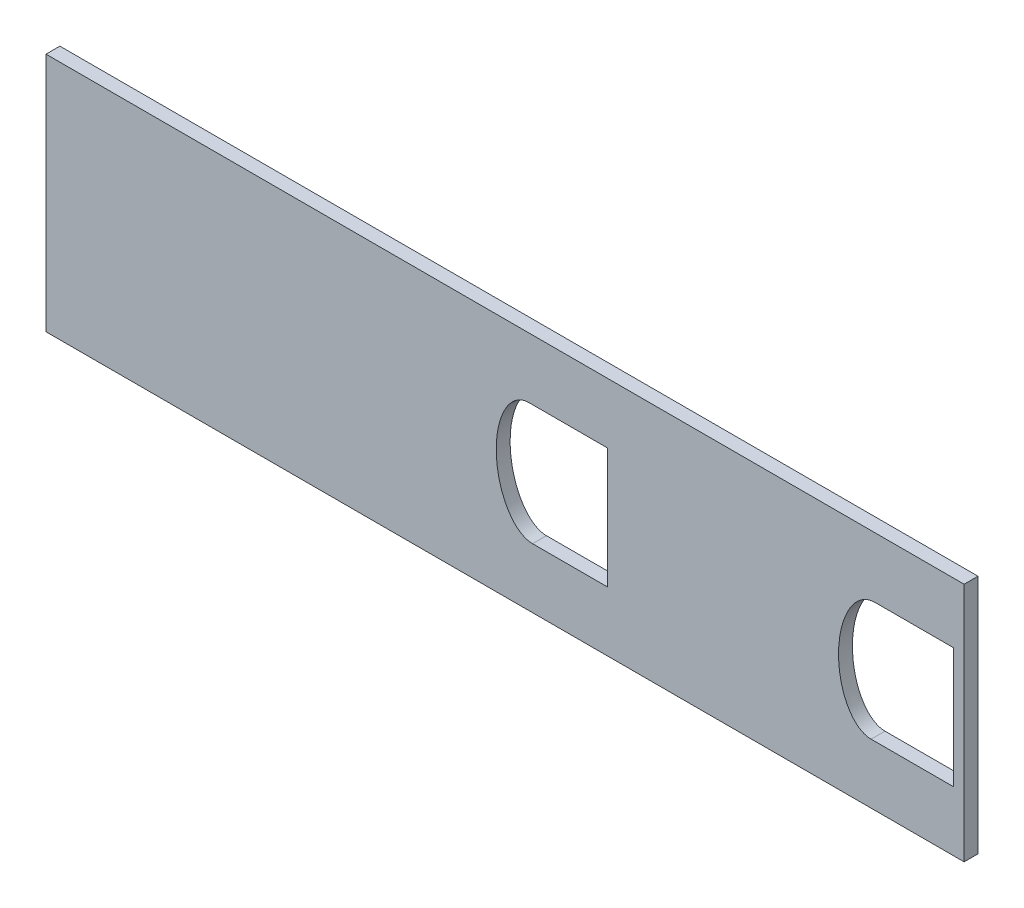
ISO-10303-21;
HEADER;
FILE_DESCRIPTION(('STEP AP214'),'2;1');
FILE_NAME('part.step','',(''),(''),'','','');
FILE_SCHEMA(('AUTOMOTIVE_DESIGN { 1 0 10303 214 1 1 1 1 }'));
ENDSEC;
DATA;
#1=APPLICATION_CONTEXT('core data for automotive mechanical design processes');
#2=APPLICATION_PROTOCOL_DEFINITION('international standard','automotive_design',2000,#1);
#3=PRODUCT_CONTEXT('',#1,'mechanical');
#4=PRODUCT('Part','Part','',(#3));
#5=PRODUCT_RELATED_PRODUCT_CATEGORY('part','',(#4));
#6=PRODUCT_DEFINITION_FORMATION('','',#4);
#7=PRODUCT_DEFINITION_CONTEXT('part definition',#1,'design');
#8=PRODUCT_DEFINITION('design','',#6,#7);
#9=PRODUCT_DEFINITION_SHAPE('','',#8);
#10=(LENGTH_UNIT() NAMED_UNIT(*) SI_UNIT(.MILLI.,.METRE.));
#11=(NAMED_UNIT(*) PLANE_ANGLE_UNIT() SI_UNIT($,.RADIAN.));
#12=(NAMED_UNIT(*) SI_UNIT($,.STERADIAN.) SOLID_ANGLE_UNIT());
#13=UNCERTAINTY_MEASURE_WITH_UNIT(LENGTH_MEASURE(1.E-05),#10,'distance_accuracy_value','');
#14=(GEOMETRIC_REPRESENTATION_CONTEXT(3) GLOBAL_UNCERTAINTY_ASSIGNED_CONTEXT((#13)) GLOBAL_UNIT_ASSIGNED_CONTEXT((#10,
#11,#12)) REPRESENTATION_CONTEXT('',''));
#15=CARTESIAN_POINT('',(0.,0.,0.));
#16=DIRECTION('',(0.,0.,1.));
#17=DIRECTION('',(1.,0.,0.));
#18=AXIS2_PLACEMENT_3D('',#15,#16,#17);
#19=CARTESIAN_POINT('',(0.,0.,3.175));
#20=DIRECTION('',(0.,0.,-1.));
#21=DIRECTION('',(-1.,0.,0.));
#22=AXIS2_PLACEMENT_3D('',#19,#20,#21);
#23=PLANE('',#22);
#24=CARTESIAN_POINT('',(-256.145946571245,-129.914535525207,3.175));
#25=CARTESIAN_POINT('',(-256.512923163438,-129.916105652913,3.175));
#26=CARTESIAN_POINT('',(-256.871976666252,-129.961276413136,3.175));
#27=CARTESIAN_POINT('',(-257.575127125787,-130.133923564444,3.175));
#28=CARTESIAN_POINT('',(-257.921636069417,-130.263410905777,3.175));
#29=CARTESIAN_POINT('',(-258.571621417541,-130.586176218645,3.175));
#30=CARTESIAN_POINT('',(-258.879489775578,-130.780210959598,3.175));
#31=CARTESIAN_POINT('',(-259.462810842354,-131.221200768919,3.175));
#32=CARTESIAN_POINT('',(-259.731937946974,-131.463068858512,3.175));
#33=CARTESIAN_POINT('',(-260.235067772947,-131.98012087023,3.175));
#34=CARTESIAN_POINT('',(-260.468977829019,-132.255392686313,3.175));
#35=CARTESIAN_POINT('',(-260.907271384866,-132.833942555549,3.175));
#36=CARTESIAN_POINT('',(-261.111268677679,-133.137182584867,3.175));
#37=CARTESIAN_POINT('',(-261.673586311515,-134.063668350993,3.175));
#38=CARTESIAN_POINT('',(-261.988251582681,-134.710018030615,3.175));
#39=CARTESIAN_POINT('',(-262.527518192638,-136.045634253011,3.175));
#40=CARTESIAN_POINT('',(-262.752464397444,-136.739423267185,3.175));
#41=CARTESIAN_POINT('',(-263.117244618423,-138.134526480922,3.175));
#42=CARTESIAN_POINT('',(-263.258245032942,-138.837666692454,3.175));
#43=CARTESIAN_POINT('',(-263.469446130367,-140.25350678251,3.175));
#44=CARTESIAN_POINT('',(-263.539513018113,-140.966224726598,3.175));
#45=CARTESIAN_POINT('',(-263.613946734782,-142.400531703257,3.175));
#46=CARTESIAN_POINT('',(-263.618118635488,-143.125138918939,3.175));
#47=CARTESIAN_POINT('',(-263.535049840951,-145.288890406299,3.175));
#48=CARTESIAN_POINT('',(-263.355011587131,-146.710051192057,3.175));
#49=CARTESIAN_POINT('',(-262.880494807648,-148.806791258549,3.175));
#50=CARTESIAN_POINT('',(-262.687866041162,-149.499806053937,3.175));
#51=CARTESIAN_POINT('',(-262.222220804156,-150.872074188592,3.175));
#52=CARTESIAN_POINT('',(-261.951824884298,-151.543353720329,3.175));
#53=CARTESIAN_POINT('',(-261.482245137831,-152.517058610564,3.175));
#54=CARTESIAN_POINT('',(-261.314868687399,-152.836389762082,3.175));
#55=CARTESIAN_POINT('',(-260.955397442808,-153.463120716963,3.175));
#56=CARTESIAN_POINT('',(-260.762547684987,-153.771633607421,3.175));
#57=CARTESIAN_POINT('',(-260.145999627634,-154.667359954438,3.175));
#58=CARTESIAN_POINT('',(-259.687952954573,-155.223199044971,3.175));
#59=CARTESIAN_POINT('',(-258.899796605441,-155.968133011314,3.175));
#60=CARTESIAN_POINT('',(-258.617726400451,-156.202737545982,3.175));
#61=CARTESIAN_POINT('',(-258.026082674822,-156.620875313244,3.175));
#62=CARTESIAN_POINT('',(-257.715719206334,-156.805710537517,3.175));
#63=CARTESIAN_POINT('',(-257.223224924768,-157.038052597829,3.175));
#64=CARTESIAN_POINT('',(-257.053549950963,-157.108271733492,3.175));
#65=CARTESIAN_POINT('',(-256.710372005906,-157.229384828597,3.175));
#66=CARTESIAN_POINT('',(-256.536705243704,-157.280483556748,3.175));
#67=CARTESIAN_POINT('',(-256.185019292948,-157.362869353131,3.175));
#68=CARTESIAN_POINT('',(-256.007000456909,-157.394158025959,3.175));
#69=CARTESIAN_POINT('',(-255.646351039637,-157.435743327176,3.175));
#70=CARTESIAN_POINT('',(-255.462490916157,-157.445957118728,3.175));
#71=CARTESIAN_POINT('',(-254.916901455293,-157.443363010651,3.175));
#72=CARTESIAN_POINT('',(-254.558988098448,-157.398217249218,3.175));
#73=CARTESIAN_POINT('',(-254.030633110303,-157.266900555764,3.175));
#74=CARTESIAN_POINT('',(-253.854994329901,-157.212068675881,3.175));
#75=CARTESIAN_POINT('',(-253.514081815182,-157.084218298334,3.175));
#76=CARTESIAN_POINT('',(-253.34814654925,-157.011165850916,3.175));
#77=CARTESIAN_POINT('',(-252.86269043692,-156.767076195649,3.175));
#78=CARTESIAN_POINT('',(-252.552918782358,-156.569092219785,3.175));
#79=CARTESIAN_POINT('',(-251.976637822077,-156.127865960309,3.175));
#80=CARTESIAN_POINT('',(-251.709745537613,-155.88536594729,3.175));
#81=CARTESIAN_POINT('',(-251.209661069469,-155.365652848024,3.175));
#82=CARTESIAN_POINT('',(-250.975927953497,-155.08752697638,3.175));
#83=CARTESIAN_POINT('',(-250.539799580046,-154.505348562684,3.175));
#84=CARTESIAN_POINT('',(-250.339793808974,-154.204740086727,3.175));
#85=CARTESIAN_POINT('',(-249.783603282288,-153.279811913683,3.175));
#86=CARTESIAN_POINT('',(-249.470669726552,-152.632692884761,3.175));
#87=CARTESIAN_POINT('',(-249.067336910667,-151.6271876715,3.175));
#88=CARTESIAN_POINT('',(-248.943832056116,-151.285125701367,3.175));
#89=CARTESIAN_POINT('',(-248.720010406052,-150.598517516299,3.175));
#90=CARTESIAN_POINT('',(-248.619326497605,-150.253217891313,3.175));
#91=CARTESIAN_POINT('',(-248.347462308419,-149.211953321545,3.175));
#92=CARTESIAN_POINT('',(-248.206246249024,-148.510662375128,3.175));
#93=CARTESIAN_POINT('',(-247.993321988715,-147.095725782209,3.175));
#94=CARTESIAN_POINT('',(-247.921729836956,-146.382059508507,3.175));
#95=CARTESIAN_POINT('',(-247.843955368269,-144.943100665753,3.175));
#96=CARTESIAN_POINT('',(-247.838198968214,-144.218551324163,3.175));
#97=CARTESIAN_POINT('',(-247.914798288682,-142.065525239397,3.175));
#98=CARTESIAN_POINT('',(-248.088499202911,-140.644600799141,3.175));
#99=CARTESIAN_POINT('',(-248.558002265887,-138.537794426442,3.175));
#100=CARTESIAN_POINT('',(-248.750893591281,-137.837154876669,3.175));
#101=CARTESIAN_POINT('',(-249.210496730663,-136.471911894025,3.175));
#102=CARTESIAN_POINT('',(-249.477345911885,-135.804616330621,3.175));
#103=CARTESIAN_POINT('',(-250.100264770085,-134.506934111839,3.175));
#104=CARTESIAN_POINT('',(-250.459274970147,-133.872000912881,3.175));
#105=CARTESIAN_POINT('',(-251.276468614764,-132.684294555382,3.175));
#106=CARTESIAN_POINT('',(-251.733816396469,-132.128803083096,3.175));
#107=CARTESIAN_POINT('',(-252.793005678947,-131.131520990881,3.175));
#108=CARTESIAN_POINT('',(-253.378396830112,-130.705090806128,3.175));
#109=CARTESIAN_POINT('',(-254.370141630469,-130.240586456427,3.175));
#110=CARTESIAN_POINT('',(-254.710681914565,-130.119988263396,3.175));
#111=CARTESIAN_POINT('',(-255.414197279891,-129.955919634128,3.175));
#112=CARTESIAN_POINT('',(-255.778969979051,-129.912965397501,3.175));
#113=CARTESIAN_POINT('',(-256.145946571245,-129.914535525207,3.175));
#114=B_SPLINE_CURVE_WITH_KNOTS('',3,(#24,#25,#26,#27,#28,#29,#30,#31,#32,#33,#34,#35,#36,#37,
#38,#39,#40,#41,#42,#43,#44,#45,#46,#47,#48,#49,#50,#51,#52,#53,#54,#55,#56,#57,#58,#59,#60,#61,
#62,#63,#64,#65,#66,#67,#68,#69,#70,#71,#72,#73,#74,#75,#76,#77,#78,#79,#80,#81,#82,#83,#84,#85,
#86,#87,#88,#89,#90,#91,#92,#93,#94,#95,#96,#97,#98,#99,#100,#101,#102,#103,#104,#105,#106,#107,
#108,#109,#110,#111,#112,#113),.UNSPECIFIED.,.T.,.F.,(4,2,2,2,2,2,2,2,2,2,2,2,2,2,2,2,2,2,2,2,2,
2,2,2,2,2,2,2,2,2,2,2,2,2,2,2,2,2,2,2,2,2,2,2,4),(0.,0.0156249999999996,0.0312499999999992,
0.0468749999999988,0.0624999999999983,0.0781249999999979,0.0937499999999975,0.124999999999998,
0.156249999999998,0.187499999999999,0.218749999999999,0.25,0.3125,0.343750000000001,
0.375000000000001,0.390625000000002,0.406250000000003,0.437500000000005,0.453125000000005,
0.468750000000005,0.476562500000004,0.484375000000003,0.492187500000002,0.500000000000001,
0.515625000000001,0.523437500000001,0.531250000000002,0.546875000000002,0.562500000000002,
0.578125000000002,0.593750000000003,0.625000000000002,0.640625000000003,0.656250000000004,
0.687500000000004,0.718750000000004,0.750000000000004,0.812500000000004,0.843750000000003,
0.875000000000002,0.90625,0.937499999999999,0.968749999999998,0.984374999999999,1.),.UNSPECIFIED.);
#115=CARTESIAN_POINT('',(-256.126515871853,-129.914493968034,3.175));
#116=VERTEX_POINT('',#115);
#117=CARTESIAN_POINT('',(-255.301947618532,-157.445143064841,3.175));
#118=VERTEX_POINT('',#117);
#119=EDGE_CURVE('E190',#116,#118,#114,.T.);
#120=ORIENTED_EDGE('',*,*,#119,.F.);
#121=DIRECTION('',(-1.,0.,0.));
#122=VECTOR('',#121,1.);
#123=CARTESIAN_POINT('',(-256.126515871853,-129.914493968034,3.175));
#124=LINE('',#123,#122);
#125=CARTESIAN_POINT('',(-238.126515871853,-129.914493968034,3.175));
#126=VERTEX_POINT('',#125);
#127=EDGE_CURVE('E205',#126,#116,#124,.T.);
#128=ORIENTED_EDGE('',*,*,#127,.F.);
#129=DIRECTION('',(0.,1.,0.));
#130=VECTOR('',#129,1.);
#131=CARTESIAN_POINT('',(-238.126515871853,-129.914493968034,3.175));
#132=LINE('',#131,#130);
#133=CARTESIAN_POINT('',(-238.126515871853,-157.445143064841,3.175));
#134=VERTEX_POINT('',#133);
#135=EDGE_CURVE('E202',#134,#126,#132,.T.);
#136=ORIENTED_EDGE('',*,*,#135,.F.);
#137=DIRECTION('',(1.,0.,0.));
#138=VECTOR('',#137,1.);
#139=CARTESIAN_POINT('',(-238.126515871853,-157.445143064841,3.175));
#140=LINE('',#139,#138);
#141=EDGE_CURVE('E195',#118,#134,#140,.T.);
#142=ORIENTED_EDGE('',*,*,#141,.F.);
#143=EDGE_LOOP('',(#120,#128,#136,#142));
#144=FACE_BOUND('',#143,.T.);
#145=DIRECTION('',(0.,-1.,0.));
#146=VECTOR('',#145,1.);
#147=CARTESIAN_POINT('',(-366.588298269733,-171.116742272036,3.175));
#148=LINE('',#147,#146);
#149=CARTESIAN_POINT('',(-366.588298269733,-116.116742272036,3.175));
#150=VERTEX_POINT('',#149);
#151=CARTESIAN_POINT('',(-366.588298269733,-171.116742272036,3.175));
#152=VERTEX_POINT('',#151);
#153=EDGE_CURVE('E233',#150,#152,#148,.T.);
#154=ORIENTED_EDGE('',*,*,#153,.T.);
#155=DIRECTION('',(1.,0.,0.));
#156=VECTOR('',#155,1.);
#157=CARTESIAN_POINT('',(-366.588298269733,-171.116742272036,3.175));
#158=LINE('',#157,#156);
#159=CARTESIAN_POINT('',(-156.588298269734,-171.116742272036,3.175));
#160=VERTEX_POINT('',#159);
#161=EDGE_CURVE('E236',#152,#160,#158,.T.);
#162=ORIENTED_EDGE('',*,*,#161,.T.);
#163=DIRECTION('',(0.,1.,0.));
#164=VECTOR('',#163,1.);
#165=CARTESIAN_POINT('',(-156.588298269734,-171.116742272036,3.175));
#166=LINE('',#165,#164);
#167=CARTESIAN_POINT('',(-156.588298269734,-116.116742272035,3.175));
#168=VERTEX_POINT('',#167);
#169=EDGE_CURVE('E239',#160,#168,#166,.T.);
#170=ORIENTED_EDGE('',*,*,#169,.T.);
#171=DIRECTION('',(-1.,0.,0.));
#172=VECTOR('',#171,1.);
#173=CARTESIAN_POINT('',(-366.588298269733,-116.116742272036,3.175));
#174=LINE('',#173,#172);
#175=EDGE_CURVE('E241',#168,#150,#174,.T.);
#176=ORIENTED_EDGE('',*,*,#175,.T.);
#177=EDGE_LOOP('',(#154,#162,#170,#176));
#178=FACE_BOUND('',#177,.T.);
#179=DIRECTION('',(1.,0.,0.));
#180=VECTOR('',#179,1.);
#181=CARTESIAN_POINT('',(-159.040464823858,-157.445142266956,3.175));
#182=LINE('',#181,#180);
#183=CARTESIAN_POINT('',(-177.864702911853,-157.445142266956,3.175));
#184=VERTEX_POINT('',#183);
#185=CARTESIAN_POINT('',(-159.040464823858,-157.445142266956,3.175));
#186=VERTEX_POINT('',#185);
#187=EDGE_CURVE('E126',#184,#186,#182,.T.);
#188=ORIENTED_EDGE('',*,*,#187,.F.);
#189=CARTESIAN_POINT('',(-177.020649968222,-129.914535525207,3.175));
#190=CARTESIAN_POINT('',(-177.387321809055,-129.912966701395,3.175));
#191=CARTESIAN_POINT('',(-177.746354088471,-129.95496307965,3.175));
#192=CARTESIAN_POINT('',(-178.450508163983,-130.118281465425,3.175));
#193=CARTESIAN_POINT('',(-178.798446547902,-130.241521216158,3.175));
#194=CARTESIAN_POINT('',(-179.784142425368,-130.703186624548,3.175));
#195=CARTESIAN_POINT('',(-180.381814164447,-131.13874587835,3.175));
#196=CARTESIAN_POINT('',(-181.168722928843,-131.880440702026,3.175));
#197=CARTESIAN_POINT('',(-181.414752425345,-132.143698936266,3.175));
#198=CARTESIAN_POINT('',(-181.879762187572,-132.69685441378,3.175));
#199=CARTESIAN_POINT('',(-182.099643916591,-132.988258366193,3.175));
#200=CARTESIAN_POINT('',(-182.71481327722,-133.884005528755,3.175));
#201=CARTESIAN_POINT('',(-183.067807311236,-134.509863609248,3.175));
#202=CARTESIAN_POINT('',(-183.688975752073,-135.804188374721,3.175));
#203=CARTESIAN_POINT('',(-183.95666142689,-136.472900571139,3.175));
#204=CARTESIAN_POINT('',(-184.418821119062,-137.847102378115,3.175));
#205=CARTESIAN_POINT('',(-184.609221950343,-138.540686474907,3.175));
#206=CARTESIAN_POINT('',(-185.076516235956,-140.63735505259,3.175));
#207=CARTESIAN_POINT('',(-185.251107731937,-142.056423330081,3.175));
#208=CARTESIAN_POINT('',(-185.328407938261,-144.213722779351,3.175));
#209=CARTESIAN_POINT('',(-185.322641078592,-144.939527831942,3.175));
#210=CARTESIAN_POINT('',(-185.245543482257,-146.373081328342,3.175));
#211=CARTESIAN_POINT('',(-185.174539397268,-147.084089598831,3.175));
#212=CARTESIAN_POINT('',(-184.963362414462,-148.493812341348,3.175));
#213=CARTESIAN_POINT('',(-184.823302582957,-149.192546909348,3.175));
#214=CARTESIAN_POINT('',(-184.463885551695,-150.575922036447,3.175));
#215=CARTESIAN_POINT('',(-184.244647865222,-151.261133882669,3.175));
#216=CARTESIAN_POINT('',(-183.705821700521,-152.61149075651,3.175));
#217=CARTESIAN_POINT('',(-183.391851140361,-153.263426637944,3.175));
#218=CARTESIAN_POINT('',(-182.832888757096,-154.195423531338,3.175));
#219=CARTESIAN_POINT('',(-182.630581647995,-154.499761515736,3.175));
#220=CARTESIAN_POINT('',(-182.19713350893,-155.079419538897,3.175));
#221=CARTESIAN_POINT('',(-181.965897633399,-155.355342095175,3.175));
#222=CARTESIAN_POINT('',(-181.468748984003,-155.87395683401,3.175));
#223=CARTESIAN_POINT('',(-181.202924714911,-156.11673382942,3.175));
#224=CARTESIAN_POINT('',(-180.771061379083,-156.449154259112,3.175));
#225=CARTESIAN_POINT('',(-180.620764555733,-156.555065498513,3.175));
#226=CARTESIAN_POINT('',(-180.313366278787,-156.750731796793,3.175));
#227=CARTESIAN_POINT('',(-180.155890029763,-156.840870645405,3.175));
#228=CARTESIAN_POINT('',(-179.83278244086,-157.004535717972,3.175));
#229=CARTESIAN_POINT('',(-179.667152798945,-157.078065400827,3.175));
#230=CARTESIAN_POINT('',(-179.326955849942,-157.206917970377,3.175));
#231=CARTESIAN_POINT('',(-179.151146530459,-157.26249459322,3.175));
#232=CARTESIAN_POINT('',(-178.620859868115,-157.396113578342,3.175));
#233=CARTESIAN_POINT('',(-178.262764542562,-157.442154367356,3.175));
#234=CARTESIAN_POINT('',(-177.718740824174,-157.446427965377,3.175));
#235=CARTESIAN_POINT('',(-177.535027400677,-157.436887853,3.175));
#236=CARTESIAN_POINT('',(-177.171727087317,-157.396076739671,3.175));
#237=CARTESIAN_POINT('',(-176.99269565791,-157.365049942896,3.175));
#238=CARTESIAN_POINT('',(-176.639528271776,-157.283140906101,3.175));
#239=CARTESIAN_POINT('',(-176.465392843633,-157.232256522202,3.175));
#240=CARTESIAN_POINT('',(-176.121756417017,-157.11169106993,3.175));
#241=CARTESIAN_POINT('',(-175.951493743014,-157.041584153268,3.175));
#242=CARTESIAN_POINT('',(-175.456921064538,-156.809142294797,3.175));
#243=CARTESIAN_POINT('',(-175.146164721496,-156.624406541132,3.175));
#244=CARTESIAN_POINT('',(-174.554890556526,-156.207445823859,3.175));
#245=CARTESIAN_POINT('',(-174.272642336544,-155.973305355685,3.175));
#246=CARTESIAN_POINT('',(-173.479870443578,-155.225049471678,3.175));
#247=CARTESIAN_POINT('',(-173.02183760495,-154.668760978625,3.175));
#248=CARTESIAN_POINT('',(-172.406711957062,-153.775701715462,3.175));
#249=CARTESIAN_POINT('',(-172.213329494371,-153.466693777325,3.175));
#250=CARTESIAN_POINT('',(-171.852331875817,-152.837583045107,3.175));
#251=CARTESIAN_POINT('',(-171.684808703217,-152.517927881897,3.175));
#252=CARTESIAN_POINT('',(-171.215852105597,-151.545751551277,3.175));
#253=CARTESIAN_POINT('',(-170.947706577336,-150.880147286395,3.175));
#254=CARTESIAN_POINT('',(-170.485008502025,-149.520014605812,3.175));
#255=CARTESIAN_POINT('',(-170.290330396417,-148.823954656766,3.175));
#256=CARTESIAN_POINT('',(-169.809797027939,-146.70516290122,3.175));
#257=CARTESIAN_POINT('',(-169.631911014098,-145.284105841542,3.175));
#258=CARTESIAN_POINT('',(-169.54883544635,-143.141519487679,3.175));
#259=CARTESIAN_POINT('',(-169.552112670553,-142.425470011083,3.175));
#260=CARTESIAN_POINT('',(-169.625149202536,-140.989390976304,3.175));
#261=CARTESIAN_POINT('',(-169.695547152695,-140.265762706895,3.175));
#262=CARTESIAN_POINT('',(-169.908026646481,-138.838349995316,3.175));
#263=CARTESIAN_POINT('',(-170.049687946525,-138.133507494753,3.175));
#264=CARTESIAN_POINT('',(-170.412913779167,-136.743817401315,3.175));
#265=CARTESIAN_POINT('',(-170.634199839421,-136.058900123791,3.175));
#266=CARTESIAN_POINT('',(-171.040759385709,-135.05019966066,3.175));
#267=CARTESIAN_POINT('',(-171.18869572219,-134.717757584608,3.175));
#268=CARTESIAN_POINT('',(-171.50892628101,-134.0696067692,3.175));
#269=CARTESIAN_POINT('',(-171.681612313822,-133.752813839276,3.175));
#270=CARTESIAN_POINT('',(-172.056066629936,-133.136075883143,3.175));
#271=CARTESIAN_POINT('',(-172.25778846851,-132.836103950615,3.175));
#272=CARTESIAN_POINT('',(-172.696576753731,-132.256635892752,3.175));
#273=CARTESIAN_POINT('',(-172.932646617769,-131.978836439373,3.175));
#274=CARTESIAN_POINT('',(-173.436458549058,-131.461355530361,3.175));
#275=CARTESIAN_POINT('',(-173.705102177537,-131.220272640697,3.175));
#276=CARTESIAN_POINT('',(-174.284269675776,-130.782288840853,3.175));
#277=CARTESIAN_POINT('',(-174.595048698299,-130.586247087856,3.175));
#278=CARTESIAN_POINT('',(-175.242345883047,-130.264602255168,3.175));
#279=CARTESIAN_POINT('',(-175.583874872607,-130.136154092789,3.175));
#280=CARTESIAN_POINT('',(-176.293410100367,-129.961212151713,3.175));
#281=CARTESIAN_POINT('',(-176.65397812739,-129.916104349019,3.175));
#282=CARTESIAN_POINT('',(-177.020649968222,-129.914535525207,3.175));
#283=B_SPLINE_CURVE_WITH_KNOTS('',3,(#189,#190,#191,#192,#193,#194,#195,#196,#197,#198,#199,
#200,#201,#202,#203,#204,#205,#206,#207,#208,#209,#210,#211,#212,#213,#214,#215,#216,#217,#218,
#219,#220,#221,#222,#223,#224,#225,#226,#227,#228,#229,#230,#231,#232,#233,#234,#235,#236,#237,
#238,#239,#240,#241,#242,#243,#244,#245,#246,#247,#248,#249,#250,#251,#252,#253,#254,#255,#256,
#257,#258,#259,#260,#261,#262,#263,#264,#265,#266,#267,#268,#269,#270,#271,#272,#273,#274,#275,
#276,#277,#278,#279,#280,#281,#282),.UNSPECIFIED.,.T.,.F.,(4,2,2,2,2,2,2,2,2,2,2,2,2,2,2,2,2,2,
2,2,2,2,2,2,2,2,2,2,2,2,2,2,2,2,2,2,2,2,2,2,2,2,2,2,2,2,4),(0.,0.0156249999999972,
0.0312499999999944,0.0624999999999898,0.078124999999988,0.0937499999999862,0.124999999999982,
0.156249999999977,0.187499999999972,0.249999999999963,0.281249999999958,0.312499999999954,
0.34374999999995,0.374999999999946,0.406249999999942,0.42187499999994,0.437499999999938,
0.453124999999935,0.460937499999935,0.468749999999934,0.476562499999934,0.484374999999933,
0.499999999999933,0.507812499999934,0.515624999999934,0.523437499999935,0.531249999999936,
0.546874999999938,0.562499999999941,0.593749999999947,0.60937499999995,0.624999999999953,
0.656249999999958,0.687499999999963,0.749999999999972,0.781249999999976,0.812499999999979,
0.843749999999983,0.874999999999987,0.890624999999988,0.90624999999999,0.921874999999992,
0.937499999999993,0.953124999999995,0.968749999999997,0.984374999999998,1.),.UNSPECIFIED.);
#284=CARTESIAN_POINT('',(-177.040464823858,-129.914493131286,3.175));
#285=VERTEX_POINT('',#284);
#286=EDGE_CURVE('E148',#285,#184,#283,.T.);
#287=ORIENTED_EDGE('',*,*,#286,.F.);
#288=DIRECTION('',(-1.,0.,0.));
#289=VECTOR('',#288,1.);
#290=CARTESIAN_POINT('',(-177.040464823858,-129.914493131286,3.175));
#291=LINE('',#290,#289);
#292=CARTESIAN_POINT('',(-159.040464823858,-129.914493131286,3.175));
#293=VERTEX_POINT('',#292);
#294=EDGE_CURVE('E146',#293,#285,#291,.T.);
#295=ORIENTED_EDGE('',*,*,#294,.F.);
#296=DIRECTION('',(0.,1.,0.));
#297=VECTOR('',#296,1.);
#298=CARTESIAN_POINT('',(-159.040464823858,-129.914493131286,3.175));
#299=LINE('',#298,#297);
#300=EDGE_CURVE('E134',#186,#293,#299,.T.);
#301=ORIENTED_EDGE('',*,*,#300,.F.);
#302=EDGE_LOOP('',(#188,#287,#295,#301));
#303=FACE_BOUND('',#302,.T.);
#304=ADVANCED_FACE('F37',(#144,#178,#303),#23,.F.);
#305=CARTESIAN_POINT('',(0.,0.,0.));
#306=DIRECTION('',(0.,0.,-1.));
#307=DIRECTION('',(-1.,0.,0.));
#308=AXIS2_PLACEMENT_3D('',#305,#306,#307);
#309=PLANE('',#308);
#310=DIRECTION('',(0.,-1.,0.));
#311=VECTOR('',#310,1.);
#312=CARTESIAN_POINT('',(-366.588298269733,-171.116742272036,0.));
#313=LINE('',#312,#311);
#314=CARTESIAN_POINT('',(-366.588298269733,-116.116742272036,0.));
#315=VERTEX_POINT('',#314);
#316=CARTESIAN_POINT('',(-366.588298269733,-171.116742272036,0.));
#317=VERTEX_POINT('',#316);
#318=EDGE_CURVE('E232',#315,#317,#313,.T.);
#319=ORIENTED_EDGE('',*,*,#318,.F.);
#320=DIRECTION('',(-1.,0.,0.));
#321=VECTOR('',#320,1.);
#322=CARTESIAN_POINT('',(-366.588298269733,-116.116742272036,0.));
#323=LINE('',#322,#321);
#324=CARTESIAN_POINT('',(-156.588298269734,-116.116742272035,0.));
#325=VERTEX_POINT('',#324);
#326=EDGE_CURVE('E237',#325,#315,#323,.T.);
#327=ORIENTED_EDGE('',*,*,#326,.F.);
#328=DIRECTION('',(0.,1.,0.));
#329=VECTOR('',#328,1.);
#330=CARTESIAN_POINT('',(-156.588298269734,-171.116742272036,0.));
#331=LINE('',#330,#329);
#332=CARTESIAN_POINT('',(-156.588298269734,-171.116742272036,0.));
#333=VERTEX_POINT('',#332);
#334=EDGE_CURVE('E248',#333,#325,#331,.T.);
#335=ORIENTED_EDGE('',*,*,#334,.F.);
#336=DIRECTION('',(1.,0.,0.));
#337=VECTOR('',#336,1.);
#338=CARTESIAN_POINT('',(-366.588298269733,-171.116742272036,0.));
#339=LINE('',#338,#337);
#340=EDGE_CURVE('E246',#317,#333,#339,.T.);
#341=ORIENTED_EDGE('',*,*,#340,.F.);
#342=EDGE_LOOP('',(#319,#327,#335,#341));
#343=FACE_BOUND('',#342,.T.);
#344=DIRECTION('',(-1.,0.,0.));
#345=VECTOR('',#344,1.);
#346=CARTESIAN_POINT('',(-256.126515871853,-129.914493968034,0.));
#347=LINE('',#346,#345);
#348=CARTESIAN_POINT('',(-238.126515871853,-129.914493968034,0.));
#349=VERTEX_POINT('',#348);
#350=CARTESIAN_POINT('',(-256.126515871853,-129.914493968034,0.));
#351=VERTEX_POINT('',#350);
#352=EDGE_CURVE('E196',#349,#351,#347,.T.);
#353=ORIENTED_EDGE('',*,*,#352,.T.);
#354=CARTESIAN_POINT('',(-256.145946571245,-129.914535525207,0.));
#355=CARTESIAN_POINT('',(-256.512923163438,-129.916105652913,0.));
#356=CARTESIAN_POINT('',(-256.871976666252,-129.961276413136,0.));
#357=CARTESIAN_POINT('',(-257.575127125787,-130.133923564444,0.));
#358=CARTESIAN_POINT('',(-257.921636069417,-130.263410905777,0.));
#359=CARTESIAN_POINT('',(-258.571621417541,-130.586176218645,0.));
#360=CARTESIAN_POINT('',(-258.879489775578,-130.780210959598,0.));
#361=CARTESIAN_POINT('',(-259.462810842354,-131.221200768919,0.));
#362=CARTESIAN_POINT('',(-259.731937946974,-131.463068858512,0.));
#363=CARTESIAN_POINT('',(-260.235067772947,-131.98012087023,0.));
#364=CARTESIAN_POINT('',(-260.468977829019,-132.255392686313,0.));
#365=CARTESIAN_POINT('',(-260.907271384866,-132.833942555549,0.));
#366=CARTESIAN_POINT('',(-261.111268677679,-133.137182584867,0.));
#367=CARTESIAN_POINT('',(-261.673586311515,-134.063668350993,0.));
#368=CARTESIAN_POINT('',(-261.988251582681,-134.710018030615,0.));
#369=CARTESIAN_POINT('',(-262.527518192638,-136.045634253011,0.));
#370=CARTESIAN_POINT('',(-262.752464397444,-136.739423267185,0.));
#371=CARTESIAN_POINT('',(-263.117244618423,-138.134526480922,0.));
#372=CARTESIAN_POINT('',(-263.258245032942,-138.837666692454,0.));
#373=CARTESIAN_POINT('',(-263.469446130367,-140.25350678251,0.));
#374=CARTESIAN_POINT('',(-263.539513018113,-140.966224726598,0.));
#375=CARTESIAN_POINT('',(-263.613946734782,-142.400531703257,0.));
#376=CARTESIAN_POINT('',(-263.618118635488,-143.125138918939,0.));
#377=CARTESIAN_POINT('',(-263.535049840951,-145.288890406299,0.));
#378=CARTESIAN_POINT('',(-263.355011587131,-146.710051192057,0.));
#379=CARTESIAN_POINT('',(-262.880494807648,-148.806791258549,0.));
#380=CARTESIAN_POINT('',(-262.687866041162,-149.499806053937,0.));
#381=CARTESIAN_POINT('',(-262.222220804156,-150.872074188592,0.));
#382=CARTESIAN_POINT('',(-261.951824884298,-151.543353720329,0.));
#383=CARTESIAN_POINT('',(-261.482245137831,-152.517058610564,0.));
#384=CARTESIAN_POINT('',(-261.314868687399,-152.836389762082,0.));
#385=CARTESIAN_POINT('',(-260.955397442808,-153.463120716963,0.));
#386=CARTESIAN_POINT('',(-260.762547684987,-153.771633607421,0.));
#387=CARTESIAN_POINT('',(-260.145999627634,-154.667359954438,0.));
#388=CARTESIAN_POINT('',(-259.687952954573,-155.223199044971,0.));
#389=CARTESIAN_POINT('',(-258.899796605441,-155.968133011314,0.));
#390=CARTESIAN_POINT('',(-258.617726400451,-156.202737545982,0.));
#391=CARTESIAN_POINT('',(-258.026082674822,-156.620875313244,0.));
#392=CARTESIAN_POINT('',(-257.715719206334,-156.805710537517,0.));
#393=CARTESIAN_POINT('',(-257.223224924768,-157.038052597829,0.));
#394=CARTESIAN_POINT('',(-257.053549950963,-157.108271733492,0.));
#395=CARTESIAN_POINT('',(-256.710372005906,-157.229384828597,0.));
#396=CARTESIAN_POINT('',(-256.536705243704,-157.280483556748,0.));
#397=CARTESIAN_POINT('',(-256.185019292948,-157.362869353131,0.));
#398=CARTESIAN_POINT('',(-256.007000456909,-157.394158025959,0.));
#399=CARTESIAN_POINT('',(-255.646351039637,-157.435743327176,0.));
#400=CARTESIAN_POINT('',(-255.462490916157,-157.445957118728,0.));
#401=CARTESIAN_POINT('',(-254.916901455293,-157.443363010651,0.));
#402=CARTESIAN_POINT('',(-254.558988098448,-157.398217249218,0.));
#403=CARTESIAN_POINT('',(-254.030633110303,-157.266900555764,0.));
#404=CARTESIAN_POINT('',(-253.854994329901,-157.212068675881,0.));
#405=CARTESIAN_POINT('',(-253.514081815182,-157.084218298334,0.));
#406=CARTESIAN_POINT('',(-253.34814654925,-157.011165850916,0.));
#407=CARTESIAN_POINT('',(-252.86269043692,-156.767076195649,0.));
#408=CARTESIAN_POINT('',(-252.552918782358,-156.569092219785,0.));
#409=CARTESIAN_POINT('',(-251.976637822077,-156.127865960309,0.));
#410=CARTESIAN_POINT('',(-251.709745537613,-155.88536594729,0.));
#411=CARTESIAN_POINT('',(-251.209661069469,-155.365652848024,0.));
#412=CARTESIAN_POINT('',(-250.975927953497,-155.08752697638,0.));
#413=CARTESIAN_POINT('',(-250.539799580046,-154.505348562684,0.));
#414=CARTESIAN_POINT('',(-250.339793808974,-154.204740086727,0.));
#415=CARTESIAN_POINT('',(-249.783603282288,-153.279811913683,0.));
#416=CARTESIAN_POINT('',(-249.470669726552,-152.632692884761,0.));
#417=CARTESIAN_POINT('',(-249.067336910667,-151.6271876715,0.));
#418=CARTESIAN_POINT('',(-248.943832056116,-151.285125701367,0.));
#419=CARTESIAN_POINT('',(-248.720010406052,-150.598517516299,0.));
#420=CARTESIAN_POINT('',(-248.619326497605,-150.253217891313,0.));
#421=CARTESIAN_POINT('',(-248.347462308419,-149.211953321545,0.));
#422=CARTESIAN_POINT('',(-248.206246249024,-148.510662375128,0.));
#423=CARTESIAN_POINT('',(-247.993321988715,-147.095725782209,0.));
#424=CARTESIAN_POINT('',(-247.921729836956,-146.382059508507,0.));
#425=CARTESIAN_POINT('',(-247.843955368269,-144.943100665753,0.));
#426=CARTESIAN_POINT('',(-247.838198968214,-144.218551324163,0.));
#427=CARTESIAN_POINT('',(-247.914798288682,-142.065525239397,0.));
#428=CARTESIAN_POINT('',(-248.088499202911,-140.644600799141,0.));
#429=CARTESIAN_POINT('',(-248.558002265887,-138.537794426442,0.));
#430=CARTESIAN_POINT('',(-248.750893591281,-137.837154876669,0.));
#431=CARTESIAN_POINT('',(-249.210496730663,-136.471911894025,0.));
#432=CARTESIAN_POINT('',(-249.477345911885,-135.804616330621,0.));
#433=CARTESIAN_POINT('',(-250.100264770085,-134.506934111839,0.));
#434=CARTESIAN_POINT('',(-250.459274970147,-133.872000912881,0.));
#435=CARTESIAN_POINT('',(-251.276468614764,-132.684294555382,0.));
#436=CARTESIAN_POINT('',(-251.733816396469,-132.128803083096,0.));
#437=CARTESIAN_POINT('',(-252.793005678947,-131.131520990881,0.));
#438=CARTESIAN_POINT('',(-253.378396830112,-130.705090806128,0.));
#439=CARTESIAN_POINT('',(-254.370141630469,-130.240586456427,0.));
#440=CARTESIAN_POINT('',(-254.710681914565,-130.119988263396,0.));
#441=CARTESIAN_POINT('',(-255.414197279891,-129.955919634128,0.));
#442=CARTESIAN_POINT('',(-255.778969979051,-129.912965397501,0.));
#443=CARTESIAN_POINT('',(-256.145946571245,-129.914535525207,0.));
#444=B_SPLINE_CURVE_WITH_KNOTS('',3,(#354,#355,#356,#357,#358,#359,#360,#361,#362,#363,#364,
#365,#366,#367,#368,#369,#370,#371,#372,#373,#374,#375,#376,#377,#378,#379,#380,#381,#382,#383,
#384,#385,#386,#387,#388,#389,#390,#391,#392,#393,#394,#395,#396,#397,#398,#399,#400,#401,#402,
#403,#404,#405,#406,#407,#408,#409,#410,#411,#412,#413,#414,#415,#416,#417,#418,#419,#420,#421,
#422,#423,#424,#425,#426,#427,#428,#429,#430,#431,#432,#433,#434,#435,#436,#437,#438,#439,#440,
#441,#442,#443),.UNSPECIFIED.,.T.,.F.,(4,2,2,2,2,2,2,2,2,2,2,2,2,2,2,2,2,2,2,2,2,2,2,2,2,2,2,2,
2,2,2,2,2,2,2,2,2,2,2,2,2,2,2,2,4),(0.,0.0156249999999996,0.0312499999999992,0.0468749999999988,
0.0624999999999983,0.0781249999999979,0.0937499999999975,0.124999999999998,0.156249999999998,
0.187499999999999,0.218749999999999,0.25,0.3125,0.343750000000001,0.375000000000001,
0.390625000000002,0.406250000000003,0.437500000000005,0.453125000000005,0.468750000000005,
0.476562500000004,0.484375000000003,0.492187500000002,0.500000000000001,0.515625000000001,
0.523437500000001,0.531250000000002,0.546875000000002,0.562500000000002,0.578125000000002,
0.593750000000003,0.625000000000002,0.640625000000003,0.656250000000004,0.687500000000004,
0.718750000000004,0.750000000000004,0.812500000000004,0.843750000000003,0.875000000000002,
0.90625,0.937499999999999,0.968749999999998,0.984374999999999,1.),.UNSPECIFIED.);
#445=CARTESIAN_POINT('',(-255.301947618532,-157.445143064841,0.));
#446=VERTEX_POINT('',#445);
#447=EDGE_CURVE('E142',#351,#446,#444,.T.);
#448=ORIENTED_EDGE('',*,*,#447,.T.);
#449=DIRECTION('',(1.,0.,0.));
#450=VECTOR('',#449,1.);
#451=CARTESIAN_POINT('',(-238.126515871853,-157.445143064841,0.));
#452=LINE('',#451,#450);
#453=CARTESIAN_POINT('',(-238.126515871853,-157.445143064841,0.));
#454=VERTEX_POINT('',#453);
#455=EDGE_CURVE('E212',#446,#454,#452,.T.);
#456=ORIENTED_EDGE('',*,*,#455,.T.);
#457=DIRECTION('',(0.,1.,0.));
#458=VECTOR('',#457,1.);
#459=CARTESIAN_POINT('',(-238.126515871853,-129.914493968034,0.));
#460=LINE('',#459,#458);
#461=EDGE_CURVE('E218',#454,#349,#460,.T.);
#462=ORIENTED_EDGE('',*,*,#461,.T.);
#463=EDGE_LOOP('',(#353,#448,#456,#462));
#464=FACE_BOUND('',#463,.T.);
#465=CARTESIAN_POINT('',(-177.020649968222,-129.914535525207,0.));
#466=CARTESIAN_POINT('',(-177.387321809055,-129.912966701395,0.));
#467=CARTESIAN_POINT('',(-177.746354088471,-129.95496307965,0.));
#468=CARTESIAN_POINT('',(-178.450508163983,-130.118281465425,0.));
#469=CARTESIAN_POINT('',(-178.798446547902,-130.241521216158,0.));
#470=CARTESIAN_POINT('',(-179.784142425368,-130.703186624548,0.));
#471=CARTESIAN_POINT('',(-180.381814164447,-131.13874587835,0.));
#472=CARTESIAN_POINT('',(-181.168722928843,-131.880440702026,0.));
#473=CARTESIAN_POINT('',(-181.414752425345,-132.143698936266,0.));
#474=CARTESIAN_POINT('',(-181.879762187572,-132.69685441378,0.));
#475=CARTESIAN_POINT('',(-182.099643916591,-132.988258366193,0.));
#476=CARTESIAN_POINT('',(-182.71481327722,-133.884005528755,0.));
#477=CARTESIAN_POINT('',(-183.067807311236,-134.509863609248,0.));
#478=CARTESIAN_POINT('',(-183.688975752073,-135.804188374721,0.));
#479=CARTESIAN_POINT('',(-183.95666142689,-136.472900571139,0.));
#480=CARTESIAN_POINT('',(-184.418821119062,-137.847102378115,0.));
#481=CARTESIAN_POINT('',(-184.609221950343,-138.540686474907,0.));
#482=CARTESIAN_POINT('',(-185.076516235956,-140.63735505259,0.));
#483=CARTESIAN_POINT('',(-185.251107731937,-142.056423330081,0.));
#484=CARTESIAN_POINT('',(-185.328407938261,-144.213722779351,0.));
#485=CARTESIAN_POINT('',(-185.322641078592,-144.939527831942,0.));
#486=CARTESIAN_POINT('',(-185.245543482257,-146.373081328342,0.));
#487=CARTESIAN_POINT('',(-185.174539397268,-147.084089598831,0.));
#488=CARTESIAN_POINT('',(-184.963362414462,-148.493812341348,0.));
#489=CARTESIAN_POINT('',(-184.823302582957,-149.192546909348,0.));
#490=CARTESIAN_POINT('',(-184.463885551695,-150.575922036447,0.));
#491=CARTESIAN_POINT('',(-184.244647865222,-151.261133882669,0.));
#492=CARTESIAN_POINT('',(-183.705821700521,-152.61149075651,0.));
#493=CARTESIAN_POINT('',(-183.391851140361,-153.263426637944,0.));
#494=CARTESIAN_POINT('',(-182.832888757096,-154.195423531338,0.));
#495=CARTESIAN_POINT('',(-182.630581647995,-154.499761515736,0.));
#496=CARTESIAN_POINT('',(-182.19713350893,-155.079419538897,0.));
#497=CARTESIAN_POINT('',(-181.965897633399,-155.355342095175,0.));
#498=CARTESIAN_POINT('',(-181.468748984003,-155.87395683401,0.));
#499=CARTESIAN_POINT('',(-181.202924714911,-156.11673382942,0.));
#500=CARTESIAN_POINT('',(-180.771061379083,-156.449154259112,0.));
#501=CARTESIAN_POINT('',(-180.620764555733,-156.555065498513,0.));
#502=CARTESIAN_POINT('',(-180.313366278787,-156.750731796793,0.));
#503=CARTESIAN_POINT('',(-180.155890029763,-156.840870645405,0.));
#504=CARTESIAN_POINT('',(-179.83278244086,-157.004535717972,0.));
#505=CARTESIAN_POINT('',(-179.667152798945,-157.078065400827,0.));
#506=CARTESIAN_POINT('',(-179.326955849942,-157.206917970377,0.));
#507=CARTESIAN_POINT('',(-179.151146530459,-157.26249459322,0.));
#508=CARTESIAN_POINT('',(-178.620859868115,-157.396113578342,0.));
#509=CARTESIAN_POINT('',(-178.262764542562,-157.442154367356,0.));
#510=CARTESIAN_POINT('',(-177.718740824174,-157.446427965377,0.));
#511=CARTESIAN_POINT('',(-177.535027400677,-157.436887853,0.));
#512=CARTESIAN_POINT('',(-177.171727087317,-157.396076739671,0.));
#513=CARTESIAN_POINT('',(-176.99269565791,-157.365049942896,0.));
#514=CARTESIAN_POINT('',(-176.639528271776,-157.283140906101,0.));
#515=CARTESIAN_POINT('',(-176.465392843633,-157.232256522202,0.));
#516=CARTESIAN_POINT('',(-176.121756417017,-157.11169106993,0.));
#517=CARTESIAN_POINT('',(-175.951493743014,-157.041584153268,0.));
#518=CARTESIAN_POINT('',(-175.456921064538,-156.809142294797,0.));
#519=CARTESIAN_POINT('',(-175.146164721496,-156.624406541132,0.));
#520=CARTESIAN_POINT('',(-174.554890556526,-156.207445823859,0.));
#521=CARTESIAN_POINT('',(-174.272642336544,-155.973305355685,0.));
#522=CARTESIAN_POINT('',(-173.479870443578,-155.225049471678,0.));
#523=CARTESIAN_POINT('',(-173.02183760495,-154.668760978625,0.));
#524=CARTESIAN_POINT('',(-172.406711957062,-153.775701715462,0.));
#525=CARTESIAN_POINT('',(-172.213329494371,-153.466693777325,0.));
#526=CARTESIAN_POINT('',(-171.852331875817,-152.837583045107,0.));
#527=CARTESIAN_POINT('',(-171.684808703217,-152.517927881897,0.));
#528=CARTESIAN_POINT('',(-171.215852105597,-151.545751551277,0.));
#529=CARTESIAN_POINT('',(-170.947706577336,-150.880147286395,0.));
#530=CARTESIAN_POINT('',(-170.485008502025,-149.520014605812,0.));
#531=CARTESIAN_POINT('',(-170.290330396417,-148.823954656766,0.));
#532=CARTESIAN_POINT('',(-169.809797027939,-146.70516290122,0.));
#533=CARTESIAN_POINT('',(-169.631911014098,-145.284105841542,0.));
#534=CARTESIAN_POINT('',(-169.54883544635,-143.141519487679,0.));
#535=CARTESIAN_POINT('',(-169.552112670553,-142.425470011083,0.));
#536=CARTESIAN_POINT('',(-169.625149202536,-140.989390976304,0.));
#537=CARTESIAN_POINT('',(-169.695547152695,-140.265762706895,0.));
#538=CARTESIAN_POINT('',(-169.908026646481,-138.838349995316,0.));
#539=CARTESIAN_POINT('',(-170.049687946525,-138.133507494753,0.));
#540=CARTESIAN_POINT('',(-170.412913779167,-136.743817401315,0.));
#541=CARTESIAN_POINT('',(-170.634199839421,-136.058900123791,0.));
#542=CARTESIAN_POINT('',(-171.040759385709,-135.05019966066,0.));
#543=CARTESIAN_POINT('',(-171.18869572219,-134.717757584608,0.));
#544=CARTESIAN_POINT('',(-171.50892628101,-134.0696067692,0.));
#545=CARTESIAN_POINT('',(-171.681612313822,-133.752813839276,0.));
#546=CARTESIAN_POINT('',(-172.056066629936,-133.136075883143,0.));
#547=CARTESIAN_POINT('',(-172.25778846851,-132.836103950615,0.));
#548=CARTESIAN_POINT('',(-172.696576753731,-132.256635892752,0.));
#549=CARTESIAN_POINT('',(-172.932646617769,-131.978836439373,0.));
#550=CARTESIAN_POINT('',(-173.436458549058,-131.461355530361,0.));
#551=CARTESIAN_POINT('',(-173.705102177537,-131.220272640697,0.));
#552=CARTESIAN_POINT('',(-174.284269675776,-130.782288840853,0.));
#553=CARTESIAN_POINT('',(-174.595048698299,-130.586247087856,0.));
#554=CARTESIAN_POINT('',(-175.242345883047,-130.264602255168,0.));
#555=CARTESIAN_POINT('',(-175.583874872607,-130.136154092789,0.));
#556=CARTESIAN_POINT('',(-176.293410100367,-129.961212151713,0.));
#557=CARTESIAN_POINT('',(-176.65397812739,-129.916104349019,0.));
#558=CARTESIAN_POINT('',(-177.020649968222,-129.914535525207,0.));
#559=B_SPLINE_CURVE_WITH_KNOTS('',3,(#465,#466,#467,#468,#469,#470,#471,#472,#473,#474,#475,
#476,#477,#478,#479,#480,#481,#482,#483,#484,#485,#486,#487,#488,#489,#490,#491,#492,#493,#494,
#495,#496,#497,#498,#499,#500,#501,#502,#503,#504,#505,#506,#507,#508,#509,#510,#511,#512,#513,
#514,#515,#516,#517,#518,#519,#520,#521,#522,#523,#524,#525,#526,#527,#528,#529,#530,#531,#532,
#533,#534,#535,#536,#537,#538,#539,#540,#541,#542,#543,#544,#545,#546,#547,#548,#549,#550,#551,
#552,#553,#554,#555,#556,#557,#558),.UNSPECIFIED.,.T.,.F.,(4,2,2,2,2,2,2,2,2,2,2,2,2,2,2,2,2,2,
2,2,2,2,2,2,2,2,2,2,2,2,2,2,2,2,2,2,2,2,2,2,2,2,2,2,2,2,4),(0.,0.0156249999999972,
0.0312499999999944,0.0624999999999898,0.078124999999988,0.0937499999999862,0.124999999999982,
0.156249999999977,0.187499999999972,0.249999999999963,0.281249999999958,0.312499999999954,
0.34374999999995,0.374999999999946,0.406249999999942,0.42187499999994,0.437499999999938,
0.453124999999935,0.460937499999935,0.468749999999934,0.476562499999934,0.484374999999933,
0.499999999999933,0.507812499999934,0.515624999999934,0.523437499999935,0.531249999999936,
0.546874999999938,0.562499999999941,0.593749999999947,0.60937499999995,0.624999999999953,
0.656249999999958,0.687499999999963,0.749999999999972,0.781249999999976,0.812499999999979,
0.843749999999983,0.874999999999987,0.890624999999988,0.90624999999999,0.921874999999992,
0.937499999999993,0.953124999999995,0.968749999999997,0.984374999999998,1.),.UNSPECIFIED.);
#560=CARTESIAN_POINT('',(-177.040464823858,-129.914493131286,0.));
#561=VERTEX_POINT('',#560);
#562=CARTESIAN_POINT('',(-177.864702911853,-157.445142266956,0.));
#563=VERTEX_POINT('',#562);
#564=EDGE_CURVE('E135',#561,#563,#559,.T.);
#565=ORIENTED_EDGE('',*,*,#564,.T.);
#566=DIRECTION('',(1.,0.,0.));
#567=VECTOR('',#566,1.);
#568=CARTESIAN_POINT('',(-159.040464823858,-157.445142266956,0.));
#569=LINE('',#568,#567);
#570=CARTESIAN_POINT('',(-159.040464823858,-157.445142266956,0.));
#571=VERTEX_POINT('',#570);
#572=EDGE_CURVE('E60',#563,#571,#569,.T.);
#573=ORIENTED_EDGE('',*,*,#572,.T.);
#574=DIRECTION('',(0.,1.,0.));
#575=VECTOR('',#574,1.);
#576=CARTESIAN_POINT('',(-159.040464823858,-129.914493131286,0.));
#577=LINE('',#576,#575);
#578=CARTESIAN_POINT('',(-159.040464823858,-129.914493131286,0.));
#579=VERTEX_POINT('',#578);
#580=EDGE_CURVE('E141',#571,#579,#577,.T.);
#581=ORIENTED_EDGE('',*,*,#580,.T.);
#582=DIRECTION('',(-1.,0.,0.));
#583=VECTOR('',#582,1.);
#584=CARTESIAN_POINT('',(-177.040464823858,-129.914493131286,0.));
#585=LINE('',#584,#583);
#586=EDGE_CURVE('E300',#579,#561,#585,.T.);
#587=ORIENTED_EDGE('',*,*,#586,.T.);
#588=EDGE_LOOP('',(#565,#573,#581,#587));
#589=FACE_BOUND('',#588,.T.);
#590=ADVANCED_FACE('F266',(#343,#464,#589),#309,.T.);
#591=CARTESIAN_POINT('',(-366.588298269733,-171.116742272036,3.175));
#592=DIRECTION('',(1.,0.,0.));
#593=DIRECTION('',(0.,0.,-1.));
#594=AXIS2_PLACEMENT_3D('',#591,#592,#593);
#595=PLANE('',#594);
#596=ORIENTED_EDGE('',*,*,#318,.T.);
#597=DIRECTION('',(0.,0.,-1.));
#598=VECTOR('',#597,1.);
#599=CARTESIAN_POINT('',(-366.588298269733,-171.116742272036,3.175));
#600=LINE('',#599,#598);
#601=EDGE_CURVE('E11',#152,#317,#600,.T.);
#602=ORIENTED_EDGE('',*,*,#601,.F.);
#603=ORIENTED_EDGE('',*,*,#153,.F.);
#604=DIRECTION('',(0.,0.,-1.));
#605=VECTOR('',#604,1.);
#606=CARTESIAN_POINT('',(-366.588298269733,-116.116742272036,3.175));
#607=LINE('',#606,#605);
#608=EDGE_CURVE('E243',#150,#315,#607,.T.);
#609=ORIENTED_EDGE('',*,*,#608,.T.);
#610=EDGE_LOOP('',(#596,#602,#603,#609));
#611=FACE_BOUND('',#610,.T.);
#612=ADVANCED_FACE('F39',(#611),#595,.F.);
#613=CARTESIAN_POINT('',(-366.588298269733,-171.116742272036,3.175));
#614=DIRECTION('',(0.,1.,0.));
#615=DIRECTION('',(0.,0.,1.));
#616=AXIS2_PLACEMENT_3D('',#613,#614,#615);
#617=PLANE('',#616);
#618=ORIENTED_EDGE('',*,*,#340,.T.);
#619=DIRECTION('',(0.,0.,-1.));
#620=VECTOR('',#619,1.);
#621=CARTESIAN_POINT('',(-156.588298269734,-171.116742272036,3.175));
#622=LINE('',#621,#620);
#623=EDGE_CURVE('E45',#160,#333,#622,.T.);
#624=ORIENTED_EDGE('',*,*,#623,.F.);
#625=ORIENTED_EDGE('',*,*,#161,.F.);
#626=ORIENTED_EDGE('',*,*,#601,.T.);
#627=EDGE_LOOP('',(#618,#624,#625,#626));
#628=FACE_BOUND('',#627,.T.);
#629=ADVANCED_FACE('F275',(#628),#617,.F.);
#630=CARTESIAN_POINT('',(-156.588298269734,-171.116742272036,3.175));
#631=DIRECTION('',(-1.,0.,0.));
#632=DIRECTION('',(0.,0.,1.));
#633=AXIS2_PLACEMENT_3D('',#630,#631,#632);
#634=PLANE('',#633);
#635=ORIENTED_EDGE('',*,*,#334,.T.);
#636=DIRECTION('',(0.,0.,-1.));
#637=VECTOR('',#636,1.);
#638=CARTESIAN_POINT('',(-156.588298269734,-116.116742272035,3.175));
#639=LINE('',#638,#637);
#640=EDGE_CURVE('E253',#168,#325,#639,.T.);
#641=ORIENTED_EDGE('',*,*,#640,.F.);
#642=ORIENTED_EDGE('',*,*,#169,.F.);
#643=ORIENTED_EDGE('',*,*,#623,.T.);
#644=EDGE_LOOP('',(#635,#641,#642,#643));
#645=FACE_BOUND('',#644,.T.);
#646=ADVANCED_FACE('F260',(#645),#634,.F.);
#647=CARTESIAN_POINT('',(-366.588298269733,-116.116742272036,3.175));
#648=DIRECTION('',(0.,-1.,0.));
#649=DIRECTION('',(1.,0.,0.));
#650=AXIS2_PLACEMENT_3D('',#647,#648,#649);
#651=PLANE('',#650);
#652=ORIENTED_EDGE('',*,*,#326,.T.);
#653=ORIENTED_EDGE('',*,*,#608,.F.);
#654=ORIENTED_EDGE('',*,*,#175,.F.);
#655=ORIENTED_EDGE('',*,*,#640,.T.);
#656=EDGE_LOOP('',(#652,#653,#654,#655));
#657=FACE_BOUND('',#656,.T.);
#658=ADVANCED_FACE('F187',(#657),#651,.F.);
#659=DIRECTION('',(0.,0.,-1.));
#660=VECTOR('',#659,1.);
#661=SURFACE_OF_LINEAR_EXTRUSION('',#114,#660);
#662=ORIENTED_EDGE('',*,*,#447,.F.);
#663=DIRECTION('',(0.,0.,-1.));
#664=VECTOR('',#663,1.);
#665=CARTESIAN_POINT('',(-256.126515871853,-129.914493968034,3.175));
#666=LINE('',#665,#664);
#667=EDGE_CURVE('E207',#116,#351,#666,.T.);
#668=ORIENTED_EDGE('',*,*,#667,.F.);
#669=ORIENTED_EDGE('',*,*,#119,.T.);
#670=DIRECTION('',(0.,0.,-1.));
#671=VECTOR('',#670,1.);
#672=CARTESIAN_POINT('',(-255.301947618532,-157.445143064841,3.175));
#673=LINE('',#672,#671);
#674=EDGE_CURVE('E229',#118,#446,#673,.T.);
#675=ORIENTED_EDGE('',*,*,#674,.T.);
#676=EDGE_LOOP('',(#662,#668,#669,#675));
#677=FACE_BOUND('',#676,.T.);
#678=ADVANCED_FACE('F182',(#677),#661,.T.);
#679=CARTESIAN_POINT('',(-238.126515871853,-157.445143064841,3.175));
#680=DIRECTION('',(0.,1.,0.));
#681=DIRECTION('',(0.,0.,1.));
#682=AXIS2_PLACEMENT_3D('',#679,#680,#681);
#683=PLANE('',#682);
#684=ORIENTED_EDGE('',*,*,#455,.F.);
#685=ORIENTED_EDGE('',*,*,#674,.F.);
#686=ORIENTED_EDGE('',*,*,#141,.T.);
#687=DIRECTION('',(0.,0.,-1.));
#688=VECTOR('',#687,1.);
#689=CARTESIAN_POINT('',(-238.126515871853,-157.445143064841,3.175));
#690=LINE('',#689,#688);
#691=EDGE_CURVE('E227',#134,#454,#690,.T.);
#692=ORIENTED_EDGE('',*,*,#691,.T.);
#693=EDGE_LOOP('',(#684,#685,#686,#692));
#694=FACE_BOUND('',#693,.T.);
#695=ADVANCED_FACE('F178',(#694),#683,.T.);
#696=CARTESIAN_POINT('',(-238.126515871853,-129.914493968034,3.175));
#697=DIRECTION('',(-1.,0.,0.));
#698=DIRECTION('',(0.,0.,1.));
#699=AXIS2_PLACEMENT_3D('',#696,#697,#698);
#700=PLANE('',#699);
#701=ORIENTED_EDGE('',*,*,#461,.F.);
#702=ORIENTED_EDGE('',*,*,#691,.F.);
#703=ORIENTED_EDGE('',*,*,#135,.T.);
#704=DIRECTION('',(0.,0.,-1.));
#705=VECTOR('',#704,1.);
#706=CARTESIAN_POINT('',(-238.126515871853,-129.914493968034,3.175));
#707=LINE('',#706,#705);
#708=EDGE_CURVE('E225',#126,#349,#707,.T.);
#709=ORIENTED_EDGE('',*,*,#708,.T.);
#710=EDGE_LOOP('',(#701,#702,#703,#709));
#711=FACE_BOUND('',#710,.T.);
#712=ADVANCED_FACE('F174',(#711),#700,.T.);
#713=CARTESIAN_POINT('',(-256.126515871853,-129.914493968034,3.175));
#714=DIRECTION('',(0.,-1.,0.));
#715=DIRECTION('',(0.,0.,-1.));
#716=AXIS2_PLACEMENT_3D('',#713,#714,#715);
#717=PLANE('',#716);
#718=ORIENTED_EDGE('',*,*,#352,.F.);
#719=ORIENTED_EDGE('',*,*,#708,.F.);
#720=ORIENTED_EDGE('',*,*,#127,.T.);
#721=ORIENTED_EDGE('',*,*,#667,.T.);
#722=EDGE_LOOP('',(#718,#719,#720,#721));
#723=FACE_BOUND('',#722,.T.);
#724=ADVANCED_FACE('F171',(#723),#717,.T.);
#725=CARTESIAN_POINT('',(-159.040464823858,-157.445142266956,3.175));
#726=DIRECTION('',(0.,1.,0.));
#727=DIRECTION('',(0.,0.,1.));
#728=AXIS2_PLACEMENT_3D('',#725,#726,#727);
#729=PLANE('',#728);
#730=ORIENTED_EDGE('',*,*,#572,.F.);
#731=DIRECTION('',(0.,0.,-1.));
#732=VECTOR('',#731,1.);
#733=CARTESIAN_POINT('',(-177.864702911853,-157.445142266956,3.175));
#734=LINE('',#733,#732);
#735=EDGE_CURVE('E130',#184,#563,#734,.T.);
#736=ORIENTED_EDGE('',*,*,#735,.F.);
#737=ORIENTED_EDGE('',*,*,#187,.T.);
#738=DIRECTION('',(0.,0.,-1.));
#739=VECTOR('',#738,1.);
#740=CARTESIAN_POINT('',(-159.040464823858,-157.445142266956,3.175));
#741=LINE('',#740,#739);
#742=EDGE_CURVE('E129',#186,#571,#741,.T.);
#743=ORIENTED_EDGE('',*,*,#742,.T.);
#744=EDGE_LOOP('',(#730,#736,#737,#743));
#745=FACE_BOUND('',#744,.T.);
#746=ADVANCED_FACE('F128',(#745),#729,.T.);
#747=CARTESIAN_POINT('',(-159.040464823858,-129.914493131286,3.175));
#748=DIRECTION('',(-1.,0.,0.));
#749=DIRECTION('',(0.,0.,1.));
#750=AXIS2_PLACEMENT_3D('',#747,#748,#749);
#751=PLANE('',#750);
#752=ORIENTED_EDGE('',*,*,#580,.F.);
#753=ORIENTED_EDGE('',*,*,#742,.F.);
#754=ORIENTED_EDGE('',*,*,#300,.T.);
#755=DIRECTION('',(0.,0.,-1.));
#756=VECTOR('',#755,1.);
#757=CARTESIAN_POINT('',(-159.040464823858,-129.914493131286,3.175));
#758=LINE('',#757,#756);
#759=EDGE_CURVE('E143',#293,#579,#758,.T.);
#760=ORIENTED_EDGE('',*,*,#759,.T.);
#761=EDGE_LOOP('',(#752,#753,#754,#760));
#762=FACE_BOUND('',#761,.T.);
#763=ADVANCED_FACE('F138',(#762),#751,.T.);
#764=CARTESIAN_POINT('',(-177.040464823858,-129.914493131286,3.175));
#765=DIRECTION('',(0.,-1.,0.));
#766=DIRECTION('',(1.,0.,0.));
#767=AXIS2_PLACEMENT_3D('',#764,#765,#766);
#768=PLANE('',#767);
#769=ORIENTED_EDGE('',*,*,#586,.F.);
#770=ORIENTED_EDGE('',*,*,#759,.F.);
#771=ORIENTED_EDGE('',*,*,#294,.T.);
#772=DIRECTION('',(0.,0.,-1.));
#773=VECTOR('',#772,1.);
#774=CARTESIAN_POINT('',(-177.040464823858,-129.914493131286,3.175));
#775=LINE('',#774,#773);
#776=EDGE_CURVE('E52',#285,#561,#775,.T.);
#777=ORIENTED_EDGE('',*,*,#776,.T.);
#778=EDGE_LOOP('',(#769,#770,#771,#777));
#779=FACE_BOUND('',#778,.T.);
#780=ADVANCED_FACE('F163',(#779),#768,.T.);
#781=DIRECTION('',(0.,0.,-1.));
#782=VECTOR('',#781,1.);
#783=SURFACE_OF_LINEAR_EXTRUSION('',#283,#782);
#784=ORIENTED_EDGE('',*,*,#564,.F.);
#785=ORIENTED_EDGE('',*,*,#776,.F.);
#786=ORIENTED_EDGE('',*,*,#286,.T.);
#787=ORIENTED_EDGE('',*,*,#735,.T.);
#788=EDGE_LOOP('',(#784,#785,#786,#787));
#789=FACE_BOUND('',#788,.T.);
#790=ADVANCED_FACE('F160',(#789),#783,.T.);
#791=CLOSED_SHELL('',(#304,#590,#612,#629,#646,#658,#678,#695,#712,#724,#746,#763,#780,#790));
#792=MANIFOLD_SOLID_BREP('B2',#791);
#793=ADVANCED_BREP_SHAPE_REPRESENTATION('',(#18,#792),#14);
#794=SHAPE_DEFINITION_REPRESENTATION(#9,#793);
ENDSEC;
END-ISO-10303-21;
